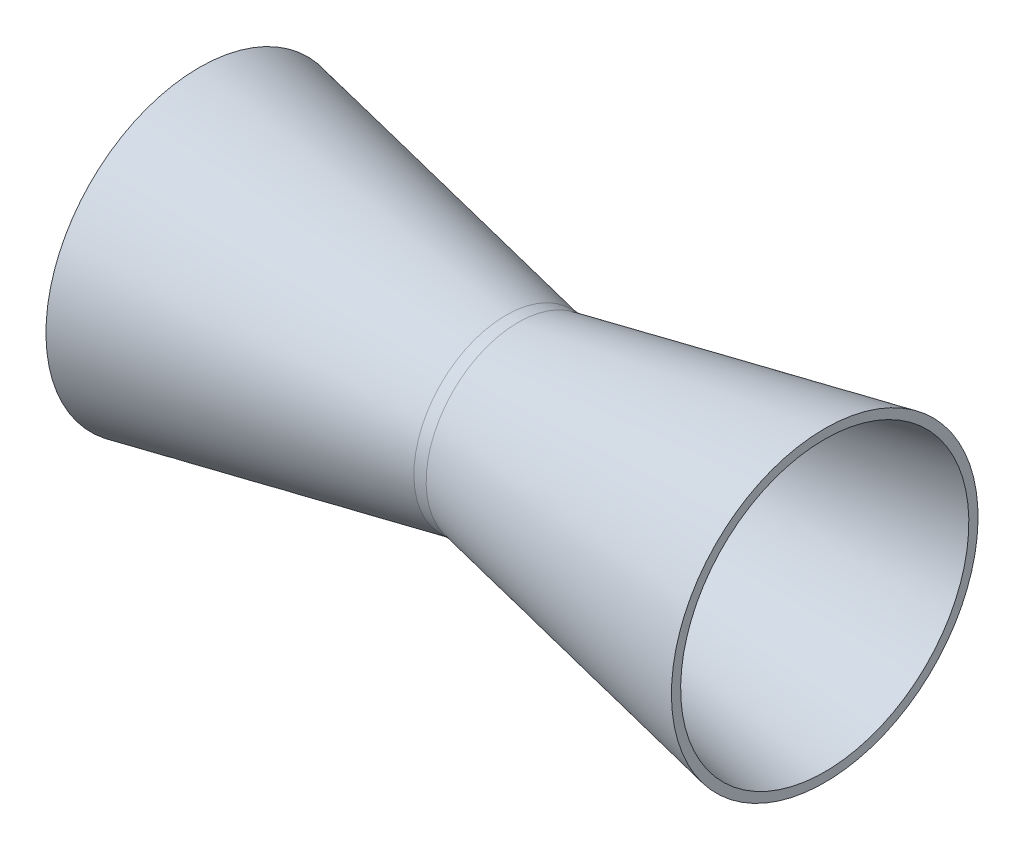
ISO-10303-21;
HEADER;
FILE_DESCRIPTION(('STEP AP214'),'2;1');
FILE_NAME('part.step','',(''),(''),'','','');
FILE_SCHEMA(('AUTOMOTIVE_DESIGN { 1 0 10303 214 1 1 1 1 }'));
ENDSEC;
DATA;
#1=APPLICATION_CONTEXT('core data for automotive mechanical design processes');
#2=APPLICATION_PROTOCOL_DEFINITION('international standard','automotive_design',2000,#1);
#3=PRODUCT_CONTEXT('',#1,'mechanical');
#4=PRODUCT('Part','Part','',(#3));
#5=PRODUCT_RELATED_PRODUCT_CATEGORY('part','',(#4));
#6=PRODUCT_DEFINITION_FORMATION('','',#4);
#7=PRODUCT_DEFINITION_CONTEXT('part definition',#1,'design');
#8=PRODUCT_DEFINITION('design','',#6,#7);
#9=PRODUCT_DEFINITION_SHAPE('','',#8);
#10=(LENGTH_UNIT() NAMED_UNIT(*) SI_UNIT(.MILLI.,.METRE.));
#11=(NAMED_UNIT(*) PLANE_ANGLE_UNIT() SI_UNIT($,.RADIAN.));
#12=(NAMED_UNIT(*) SI_UNIT($,.STERADIAN.) SOLID_ANGLE_UNIT());
#13=UNCERTAINTY_MEASURE_WITH_UNIT(LENGTH_MEASURE(1.E-05),#10,'distance_accuracy_value','');
#14=(GEOMETRIC_REPRESENTATION_CONTEXT(3) GLOBAL_UNCERTAINTY_ASSIGNED_CONTEXT((#13)) GLOBAL_UNIT_ASSIGNED_CONTEXT((#10,
#11,#12)) REPRESENTATION_CONTEXT('',''));
#15=CARTESIAN_POINT('',(0.,0.,0.));
#16=DIRECTION('',(0.,0.,1.));
#17=DIRECTION('',(1.,0.,0.));
#18=AXIS2_PLACEMENT_3D('',#15,#16,#17);
#19=CARTESIAN_POINT('',(0.,0.,0.));
#20=DIRECTION('',(1.,0.,0.));
#21=DIRECTION('',(0.,0.,-1.));
#22=AXIS2_PLACEMENT_3D('',#19,#20,#21);
#23=PLANE('',#22);
#24=CARTESIAN_POINT('',(0.,0.,0.));
#25=DIRECTION('',(1.,0.,0.));
#26=DIRECTION('',(0.,0.,-1.));
#27=AXIS2_PLACEMENT_3D('',#24,#25,#26);
#28=CIRCLE('',#27,47.);
#29=CARTESIAN_POINT('',(0.,0.,-47.));
#30=VERTEX_POINT('',#29);
#31=EDGE_CURVE('E122',#30,#30,#28,.T.);
#32=ORIENTED_EDGE('',*,*,#31,.T.);
#33=EDGE_LOOP('',(#32));
#34=FACE_BOUND('',#33,.T.);
#35=CARTESIAN_POINT('',(0.,0.,0.));
#36=DIRECTION('',(1.,0.,0.));
#37=DIRECTION('',(0.,0.,-1.));
#38=AXIS2_PLACEMENT_3D('',#35,#36,#37);
#39=CIRCLE('',#38,50.);
#40=CARTESIAN_POINT('',(0.,50.,0.));
#41=VERTEX_POINT('',#40);
#42=EDGE_CURVE('E115',#41,#41,#39,.T.);
#43=ORIENTED_EDGE('',*,*,#42,.F.);
#44=EDGE_LOOP('',(#43));
#45=FACE_BOUND('',#44,.T.);
#46=ADVANCED_FACE('F101',(#34,#45),#23,.F.);
#47=CARTESIAN_POINT('',(0.,50.,0.));
#48=CARTESIAN_POINT('',(33.3333333333333,43.3333333333333,0.));
#49=CARTESIAN_POINT('',(66.6666666666667,36.6666666666667,0.));
#50=CARTESIAN_POINT('',(100.,30.,0.));
#51=CARTESIAN_POINT('',(0.,50.,1.37978752480773));
#52=CARTESIAN_POINT('',(33.3333333333333,43.3333333333333,1.19581585483337));
#53=CARTESIAN_POINT('',(66.6666666666667,36.6666666666667,1.01184418485901));
#54=CARTESIAN_POINT('',(100.,30.,0.827872514884642));
#55=CARTESIAN_POINT('',(0.,49.8879787524808,4.11340506946168));
#56=CARTESIAN_POINT('',(33.3333333333333,43.23624825215,3.56495106020012));
#57=CARTESIAN_POINT('',(66.6666666666667,36.5845177518192,3.01649705093856));
#58=CARTESIAN_POINT('',(100.,29.9327872514885,2.46804304167701));
#59=CARTESIAN_POINT('',(0.,49.3967927000279,8.12304931017431));
#60=CARTESIAN_POINT('',(33.3333333333333,42.8105536733575,7.03997606881773));
#61=CARTESIAN_POINT('',(66.6666666666667,36.2243146466871,5.95690282746116));
#62=CARTESIAN_POINT('',(100.,29.6380756200167,4.87382958610459));
#63=CARTESIAN_POINT('',(0.,48.5953620277847,12.029001913235));
#64=CARTESIAN_POINT('',(33.3333333333333,42.11598042408,10.4251349914703));
#65=CARTESIAN_POINT('',(66.6666666666667,35.6365988203754,8.82126806970566));
#66=CARTESIAN_POINT('',(100.,29.1572172166708,7.217401147941));
#67=CARTESIAN_POINT('',(0.,42.0027676438849,34.7651103373854));
#68=CARTESIAN_POINT('',(33.3333333333333,36.4023986247003,30.1297622924007));
#69=CARTESIAN_POINT('',(66.6666666666667,30.8020296055156,25.494414247416));
#70=CARTESIAN_POINT('',(100.,25.201660586331,20.8590662024312));
#71=CARTESIAN_POINT('',(0.,22.076600396924,50.));
#72=CARTESIAN_POINT('',(33.3333333333333,19.1330536773341,43.3333333333333));
#73=CARTESIAN_POINT('',(66.6666666666667,16.1895069577443,36.6666666666667));
#74=CARTESIAN_POINT('',(100.,13.2459602381544,30.));
#75=CARTESIAN_POINT('',(0.,-27.595750496155,50.));
#76=CARTESIAN_POINT('',(33.3333333333333,-23.9163170966677,43.3333333333333));
#77=CARTESIAN_POINT('',(66.6666666666667,-20.2368836971803,36.6666666666667));
#78=CARTESIAN_POINT('',(100.,-16.557450297693,30.));
#79=CARTESIAN_POINT('',(0.,-50.,27.595750496155));
#80=CARTESIAN_POINT('',(33.3333333333333,-43.3333333333333,23.9163170966677));
#81=CARTESIAN_POINT('',(66.6666666666667,-36.6666666666667,20.2368836971803));
#82=CARTESIAN_POINT('',(100.,-30.,16.557450297693));
#83=CARTESIAN_POINT('',(0.,-50.,-27.595750496155));
#84=CARTESIAN_POINT('',(33.3333333333333,-43.3333333333333,-23.9163170966677));
#85=CARTESIAN_POINT('',(66.6666666666667,-36.6666666666667,-20.2368836971803));
#86=CARTESIAN_POINT('',(100.,-30.,-16.557450297693));
#87=CARTESIAN_POINT('',(0.,-27.595750496155,-50.));
#88=CARTESIAN_POINT('',(33.3333333333333,-23.9163170966677,-43.3333333333333));
#89=CARTESIAN_POINT('',(66.6666666666667,-20.2368836971803,-36.6666666666667));
#90=CARTESIAN_POINT('',(100.,-16.557450297693,-30.));
#91=CARTESIAN_POINT('',(0.,22.076600396924,-50.));
#92=CARTESIAN_POINT('',(33.3333333333333,19.1330536773341,-43.3333333333333));
#93=CARTESIAN_POINT('',(66.6666666666667,16.1895069577443,-36.6666666666667));
#94=CARTESIAN_POINT('',(100.,13.2459602381544,-30.));
#95=CARTESIAN_POINT('',(0.,42.0027676438849,-34.7651103373854));
#96=CARTESIAN_POINT('',(33.3333333333333,36.4023986247003,-30.1297622924007));
#97=CARTESIAN_POINT('',(66.6666666666667,30.8020296055156,-25.494414247416));
#98=CARTESIAN_POINT('',(100.,25.201660586331,-20.8590662024312));
#99=CARTESIAN_POINT('',(0.,48.5953620277847,-12.029001913235));
#100=CARTESIAN_POINT('',(33.3333333333333,42.1159804240801,-10.4251349914703));
#101=CARTESIAN_POINT('',(66.6666666666667,35.6365988203754,-8.82126806970568));
#102=CARTESIAN_POINT('',(100.,29.1572172166708,-7.21740114794101));
#103=CARTESIAN_POINT('',(0.,49.3967927000279,-8.12304931017433));
#104=CARTESIAN_POINT('',(33.3333333333333,42.8105536733575,-7.03997606881776));
#105=CARTESIAN_POINT('',(66.6666666666667,36.2243146466871,-5.95690282746118));
#106=CARTESIAN_POINT('',(100.,29.6380756200167,-4.8738295861046));
#107=CARTESIAN_POINT('',(0.,49.8879787524808,-4.11340506946171));
#108=CARTESIAN_POINT('',(33.3333333333333,43.23624825215,-3.56495106020015));
#109=CARTESIAN_POINT('',(66.6666666666667,36.5845177518192,-3.01649705093859));
#110=CARTESIAN_POINT('',(100.,29.9327872514885,-2.46804304167702));
#111=CARTESIAN_POINT('',(0.,50.,-1.37978752480776));
#112=CARTESIAN_POINT('',(33.3333333333333,43.3333333333333,-1.19581585483339));
#113=CARTESIAN_POINT('',(66.6666666666667,36.6666666666667,-1.01184418485902));
#114=CARTESIAN_POINT('',(100.,30.,-0.827872514884652));
#115=CARTESIAN_POINT('',(0.,50.,0.));
#116=CARTESIAN_POINT('',(33.3333333333333,43.3333333333333,0.));
#117=CARTESIAN_POINT('',(66.6666666666667,36.6666666666667,0.));
#118=CARTESIAN_POINT('',(100.,30.,0.));
#119=B_SPLINE_SURFACE_WITH_KNOTS('',3,3,((#47,#48,#49,#50),(#51,#52,#53,#54),(#55,#56,#57,#58),
(#59,#60,#61,#62),(#63,#64,#65,#66),(#67,#68,#69,#70),(#71,#72,#73,#74),(#75,#76,#77,#78),(#79,
#80,#81,#82),(#83,#84,#85,#86),(#87,#88,#89,#90),(#91,#92,#93,#94),(#95,#96,#97,#98),(#99,#100,
#101,#102),(#103,#104,#105,#106),(#107,#108,#109,#110),(#111,#112,#113,#114),(#115,#116,#117,
#118)),.UNSPECIFIED.,.T.,.F.,.F.,(4,1,1,1,1,2,2,2,1,1,1,1,4),(4,4),(0.,0.0125,
0.0249999999999999,0.0375000000000001,0.05,0.25,0.5,0.75,0.95,0.9625,0.975,0.9875,1.),(0.,1.),.UNSPECIFIED.);
#120=CARTESIAN_POINT('',(100.,0.,0.));
#121=DIRECTION('',(1.,0.,0.));
#122=DIRECTION('',(0.,0.,-1.));
#123=AXIS2_PLACEMENT_3D('',#120,#121,#122);
#124=CIRCLE('',#123,30.);
#125=CARTESIAN_POINT('',(100.,30.,0.));
#126=VERTEX_POINT('',#125);
#127=EDGE_CURVE('E12',#126,#126,#124,.T.);
#128=CARTESIAN_POINT('',(0.,50.,0.));
#129=CARTESIAN_POINT('',(1.04166666666667,49.7916666666667,0.));
#130=CARTESIAN_POINT('',(2.08333333333333,49.5833333333333,0.));
#131=CARTESIAN_POINT('',(4.16666666666667,49.1666666666667,0.));
#132=CARTESIAN_POINT('',(5.20833333333333,48.9583333333333,0.));
#133=CARTESIAN_POINT('',(7.29166666666667,48.5416666666667,0.));
#134=CARTESIAN_POINT('',(8.33333333333334,48.3333333333333,0.));
#135=CARTESIAN_POINT('',(10.4166666666667,47.9166666666667,0.));
#136=CARTESIAN_POINT('',(11.4583333333333,47.7083333333333,0.));
#137=CARTESIAN_POINT('',(13.5416666666667,47.2916666666667,0.));
#138=CARTESIAN_POINT('',(14.5833333333333,47.0833333333333,0.));
#139=CARTESIAN_POINT('',(16.6666666666667,46.6666666666667,0.));
#140=CARTESIAN_POINT('',(17.7083333333333,46.4583333333333,0.));
#141=CARTESIAN_POINT('',(19.7916666666667,46.0416666666667,0.));
#142=CARTESIAN_POINT('',(20.8333333333333,45.8333333333333,0.));
#143=CARTESIAN_POINT('',(22.9166666666667,45.4166666666667,0.));
#144=CARTESIAN_POINT('',(23.9583333333333,45.2083333333333,0.));
#145=CARTESIAN_POINT('',(26.0416666666667,44.7916666666667,0.));
#146=CARTESIAN_POINT('',(27.0833333333333,44.5833333333333,0.));
#147=CARTESIAN_POINT('',(29.1666666666667,44.1666666666667,0.));
#148=CARTESIAN_POINT('',(30.2083333333333,43.9583333333333,0.));
#149=CARTESIAN_POINT('',(32.2916666666667,43.5416666666667,0.));
#150=CARTESIAN_POINT('',(33.3333333333333,43.3333333333333,0.));
#151=CARTESIAN_POINT('',(35.4166666666667,42.9166666666667,0.));
#152=CARTESIAN_POINT('',(36.4583333333333,42.7083333333333,0.));
#153=CARTESIAN_POINT('',(38.5416666666667,42.2916666666667,0.));
#154=CARTESIAN_POINT('',(39.5833333333333,42.0833333333333,0.));
#155=CARTESIAN_POINT('',(41.6666666666667,41.6666666666667,0.));
#156=CARTESIAN_POINT('',(42.7083333333333,41.4583333333333,0.));
#157=CARTESIAN_POINT('',(44.7916666666667,41.0416666666667,0.));
#158=CARTESIAN_POINT('',(45.8333333333333,40.8333333333333,0.));
#159=CARTESIAN_POINT('',(47.9166666666667,40.4166666666667,0.));
#160=CARTESIAN_POINT('',(48.9583333333333,40.2083333333333,0.));
#161=CARTESIAN_POINT('',(51.0416666666667,39.7916666666667,0.));
#162=CARTESIAN_POINT('',(52.0833333333333,39.5833333333333,0.));
#163=CARTESIAN_POINT('',(54.1666666666667,39.1666666666667,0.));
#164=CARTESIAN_POINT('',(55.2083333333333,38.9583333333333,0.));
#165=CARTESIAN_POINT('',(57.2916666666667,38.5416666666667,0.));
#166=CARTESIAN_POINT('',(58.3333333333333,38.3333333333333,0.));
#167=CARTESIAN_POINT('',(60.4166666666667,37.9166666666667,0.));
#168=CARTESIAN_POINT('',(61.4583333333333,37.7083333333333,0.));
#169=CARTESIAN_POINT('',(63.5416666666667,37.2916666666667,0.));
#170=CARTESIAN_POINT('',(64.5833333333333,37.0833333333333,0.));
#171=CARTESIAN_POINT('',(66.6666666666667,36.6666666666667,0.));
#172=CARTESIAN_POINT('',(67.7083333333333,36.4583333333333,0.));
#173=CARTESIAN_POINT('',(69.7916666666667,36.0416666666667,0.));
#174=CARTESIAN_POINT('',(70.8333333333333,35.8333333333333,0.));
#175=CARTESIAN_POINT('',(72.9166666666667,35.4166666666667,0.));
#176=CARTESIAN_POINT('',(73.9583333333333,35.2083333333333,0.));
#177=CARTESIAN_POINT('',(76.0416666666667,34.7916666666667,0.));
#178=CARTESIAN_POINT('',(77.0833333333333,34.5833333333333,0.));
#179=CARTESIAN_POINT('',(79.1666666666667,34.1666666666667,0.));
#180=CARTESIAN_POINT('',(80.2083333333333,33.9583333333333,0.));
#181=CARTESIAN_POINT('',(82.2916666666667,33.5416666666667,0.));
#182=CARTESIAN_POINT('',(83.3333333333333,33.3333333333333,0.));
#183=CARTESIAN_POINT('',(85.4166666666667,32.9166666666667,0.));
#184=CARTESIAN_POINT('',(86.4583333333333,32.7083333333333,0.));
#185=CARTESIAN_POINT('',(88.5416666666667,32.2916666666667,0.));
#186=CARTESIAN_POINT('',(89.5833333333333,32.0833333333333,0.));
#187=CARTESIAN_POINT('',(91.6666666666667,31.6666666666667,0.));
#188=CARTESIAN_POINT('',(92.7083333333333,31.4583333333333,0.));
#189=CARTESIAN_POINT('',(94.7916666666667,31.0416666666667,0.));
#190=CARTESIAN_POINT('',(95.8333333333333,30.8333333333333,0.));
#191=CARTESIAN_POINT('',(97.9166666666667,30.4166666666667,0.));
#192=CARTESIAN_POINT('',(98.9583333333333,30.2083333333333,0.));
#193=CARTESIAN_POINT('',(100.,30.,0.));
#194=B_SPLINE_CURVE_WITH_KNOTS('',3,(#128,#129,#130,#131,#132,#133,#134,#135,#136,#137,#138,
#139,#140,#141,#142,#143,#144,#145,#146,#147,#148,#149,#150,#151,#152,#153,#154,#155,#156,#157,
#158,#159,#160,#161,#162,#163,#164,#165,#166,#167,#168,#169,#170,#171,#172,#173,#174,#175,#176,
#177,#178,#179,#180,#181,#182,#183,#184,#185,#186,#187,#188,#189,#190,#191,#192,#193),
.UNSPECIFIED.,.F.,.F.,(4,2,2,2,2,2,2,2,2,2,2,2,2,2,2,2,2,2,2,2,2,2,2,2,2,2,2,2,2,2,2,2,4),(0.,
3.18688719599549,6.37377439199098,9.56066158798647,12.747548783982,15.9344359799775,
19.1213231759729,22.3082103719684,25.4950975679639,28.6819847639594,31.8688719599549,
35.0557591559504,38.2426463519459,41.4295335479414,44.6164207439369,47.8033079399324,
50.9901951359279,54.1770823319233,57.3639695279188,60.5508567239143,63.7377439199098,
66.9246311159053,70.1115183119008,73.2984055078963,76.4852927038918,79.6721798998873,
82.8590670958828,86.0459542918783,89.2328414878738,92.4197286838693,95.6066158798647,
98.7935030758602,101.980390271856),.UNSPECIFIED.);
#195=EDGE_CURVE('BSEAM103',#41,#126,#194,.T.);
#196=ORIENTED_EDGE('',*,*,#42,.T.);
#197=ORIENTED_EDGE('',*,*,#127,.F.);
#198=ORIENTED_EDGE('',*,*,#195,.T.);
#199=ORIENTED_EDGE('',*,*,#195,.F.);
#200=EDGE_LOOP('',(#196,#198,#197,#199));
#201=FACE_BOUND('',#200,.T.);
#202=ADVANCED_FACE('F103',(#201),#119,.T.);
#203=CARTESIAN_POINT('',(100.,0.,0.));
#204=DIRECTION('',(-1.,0.,0.));
#205=DIRECTION('',(0.,0.,1.));
#206=AXIS2_PLACEMENT_3D('',#203,#204,#205);
#207=CONICAL_SURFACE('',#206,28.,0.187761946513593);
#208=ORIENTED_EDGE('',*,*,#31,.F.);
#209=EDGE_LOOP('',(#208));
#210=FACE_BOUND('',#209,.T.);
#211=CARTESIAN_POINT('',(100.,0.,0.));
#212=DIRECTION('',(1.,0.,0.));
#213=DIRECTION('',(0.,0.,-1.));
#214=AXIS2_PLACEMENT_3D('',#211,#212,#213);
#215=CIRCLE('',#214,28.);
#216=CARTESIAN_POINT('',(100.,0.,-28.));
#217=VERTEX_POINT('',#216);
#218=EDGE_CURVE('E133',#217,#217,#215,.T.);
#219=ORIENTED_EDGE('',*,*,#218,.T.);
#220=EDGE_LOOP('',(#219));
#221=FACE_BOUND('',#220,.T.);
#222=ADVANCED_FACE('F156',(#210,#221),#207,.F.);
#223=CARTESIAN_POINT('',(104.,0.,0.));
#224=DIRECTION('',(-1.,0.,0.));
#225=DIRECTION('',(0.,0.,1.));
#226=AXIS2_PLACEMENT_3D('',#223,#224,#225);
#227=CYLINDRICAL_SURFACE('',#226,30.);
#228=CARTESIAN_POINT('',(104.,0.,0.));
#229=DIRECTION('',(1.,0.,0.));
#230=DIRECTION('',(0.,0.,-1.));
#231=AXIS2_PLACEMENT_3D('',#228,#229,#230);
#232=CIRCLE('',#231,30.);
#233=CARTESIAN_POINT('',(104.,30.,0.));
#234=VERTEX_POINT('',#233);
#235=EDGE_CURVE('E129',#234,#234,#232,.T.);
#236=ORIENTED_EDGE('',*,*,#235,.F.);
#237=EDGE_LOOP('',(#236));
#238=FACE_BOUND('',#237,.T.);
#239=ORIENTED_EDGE('',*,*,#127,.T.);
#240=EDGE_LOOP('',(#239));
#241=FACE_BOUND('',#240,.T.);
#242=ADVANCED_FACE('F145',(#238,#241),#227,.T.);
#243=CARTESIAN_POINT('',(104.,0.,0.));
#244=DIRECTION('',(-1.,0.,0.));
#245=DIRECTION('',(0.,0.,1.));
#246=AXIS2_PLACEMENT_3D('',#243,#244,#245);
#247=CYLINDRICAL_SURFACE('',#246,28.);
#248=CARTESIAN_POINT('',(104.,0.,0.));
#249=DIRECTION('',(1.,0.,0.));
#250=DIRECTION('',(0.,0.,-1.));
#251=AXIS2_PLACEMENT_3D('',#248,#249,#250);
#252=CIRCLE('',#251,28.);
#253=CARTESIAN_POINT('',(104.,28.,0.));
#254=VERTEX_POINT('',#253);
#255=EDGE_CURVE('E219',#254,#254,#252,.T.);
#256=ORIENTED_EDGE('',*,*,#255,.T.);
#257=EDGE_LOOP('',(#256));
#258=FACE_BOUND('',#257,.T.);
#259=ORIENTED_EDGE('',*,*,#218,.F.);
#260=EDGE_LOOP('',(#259));
#261=FACE_BOUND('',#260,.T.);
#262=ADVANCED_FACE('F155',(#258,#261),#247,.F.);
#263=CARTESIAN_POINT('',(204.,0.,0.));
#264=DIRECTION('',(1.,0.,0.));
#265=DIRECTION('',(0.,0.,-1.));
#266=AXIS2_PLACEMENT_3D('',#263,#264,#265);
#267=PLANE('',#266);
#268=CARTESIAN_POINT('',(204.,0.,0.));
#269=DIRECTION('',(1.,0.,0.));
#270=DIRECTION('',(0.,0.,-1.));
#271=AXIS2_PLACEMENT_3D('',#268,#269,#270);
#272=CIRCLE('',#271,47.);
#273=CARTESIAN_POINT('',(204.,47.,0.));
#274=VERTEX_POINT('',#273);
#275=EDGE_CURVE('E281',#274,#274,#272,.T.);
#276=ORIENTED_EDGE('',*,*,#275,.F.);
#277=EDGE_LOOP('',(#276));
#278=FACE_BOUND('',#277,.T.);
#279=CARTESIAN_POINT('',(204.,0.,0.));
#280=DIRECTION('',(1.,0.,0.));
#281=DIRECTION('',(0.,0.,-1.));
#282=AXIS2_PLACEMENT_3D('',#279,#280,#281);
#283=CIRCLE('',#282,50.);
#284=CARTESIAN_POINT('',(204.,50.,0.));
#285=VERTEX_POINT('',#284);
#286=EDGE_CURVE('E216',#285,#285,#283,.T.);
#287=ORIENTED_EDGE('',*,*,#286,.T.);
#288=EDGE_LOOP('',(#287));
#289=FACE_BOUND('',#288,.T.);
#290=ADVANCED_FACE('F228',(#278,#289),#267,.T.);
#291=CARTESIAN_POINT('',(104.,30.,0.));
#292=CARTESIAN_POINT('',(137.333333333333,36.6666666666667,0.));
#293=CARTESIAN_POINT('',(170.666666666667,43.3333333333333,0.));
#294=CARTESIAN_POINT('',(204.,50.,0.));
#295=CARTESIAN_POINT('',(104.,30.,0.827872514884642));
#296=CARTESIAN_POINT('',(137.333333333333,36.6666666666667,1.01184418485901));
#297=CARTESIAN_POINT('',(170.666666666667,43.3333333333333,1.19581585483337));
#298=CARTESIAN_POINT('',(204.,50.,1.37978752480773));
#299=CARTESIAN_POINT('',(104.,29.9327872514885,2.46804304167701));
#300=CARTESIAN_POINT('',(137.333333333333,36.5845177518192,3.01649705093856));
#301=CARTESIAN_POINT('',(170.666666666667,43.23624825215,3.56495106020012));
#302=CARTESIAN_POINT('',(204.,49.8879787524808,4.11340506946168));
#303=CARTESIAN_POINT('',(104.,29.6380756200167,4.87382958610459));
#304=CARTESIAN_POINT('',(137.333333333333,36.2243146466871,5.95690282746116));
#305=CARTESIAN_POINT('',(170.666666666667,42.8105536733575,7.03997606881774));
#306=CARTESIAN_POINT('',(204.,49.3967927000279,8.12304931017431));
#307=CARTESIAN_POINT('',(104.,29.1572172166708,7.217401147941));
#308=CARTESIAN_POINT('',(137.333333333333,35.6365988203754,8.82126806970566));
#309=CARTESIAN_POINT('',(170.666666666667,42.11598042408,10.4251349914703));
#310=CARTESIAN_POINT('',(204.,48.5953620277847,12.029001913235));
#311=CARTESIAN_POINT('',(104.,25.201660586331,20.8590662024312));
#312=CARTESIAN_POINT('',(137.333333333333,30.8020296055156,25.494414247416));
#313=CARTESIAN_POINT('',(170.666666666667,36.4023986247003,30.1297622924007));
#314=CARTESIAN_POINT('',(204.,42.0027676438849,34.7651103373854));
#315=CARTESIAN_POINT('',(104.,13.2459602381544,30.));
#316=CARTESIAN_POINT('',(137.333333333333,16.1895069577443,36.6666666666667));
#317=CARTESIAN_POINT('',(170.666666666667,19.1330536773341,43.3333333333333));
#318=CARTESIAN_POINT('',(204.,22.076600396924,50.));
#319=CARTESIAN_POINT('',(104.,-16.557450297693,30.));
#320=CARTESIAN_POINT('',(137.333333333333,-20.2368836971803,36.6666666666667));
#321=CARTESIAN_POINT('',(170.666666666667,-23.9163170966677,43.3333333333333));
#322=CARTESIAN_POINT('',(204.,-27.595750496155,50.));
#323=CARTESIAN_POINT('',(104.,-30.,16.557450297693));
#324=CARTESIAN_POINT('',(137.333333333333,-36.6666666666667,20.2368836971803));
#325=CARTESIAN_POINT('',(170.666666666667,-43.3333333333333,23.9163170966677));
#326=CARTESIAN_POINT('',(204.,-50.,27.595750496155));
#327=CARTESIAN_POINT('',(104.,-30.,-16.557450297693));
#328=CARTESIAN_POINT('',(137.333333333333,-36.6666666666667,-20.2368836971803));
#329=CARTESIAN_POINT('',(170.666666666667,-43.3333333333333,-23.9163170966677));
#330=CARTESIAN_POINT('',(204.,-50.,-27.595750496155));
#331=CARTESIAN_POINT('',(104.,-16.557450297693,-30.));
#332=CARTESIAN_POINT('',(137.333333333333,-20.2368836971803,-36.6666666666667));
#333=CARTESIAN_POINT('',(170.666666666667,-23.9163170966677,-43.3333333333333));
#334=CARTESIAN_POINT('',(204.,-27.595750496155,-50.));
#335=CARTESIAN_POINT('',(104.,13.2459602381544,-30.));
#336=CARTESIAN_POINT('',(137.333333333333,16.1895069577443,-36.6666666666667));
#337=CARTESIAN_POINT('',(170.666666666667,19.1330536773341,-43.3333333333333));
#338=CARTESIAN_POINT('',(204.,22.076600396924,-50.));
#339=CARTESIAN_POINT('',(104.,25.201660586331,-20.8590662024312));
#340=CARTESIAN_POINT('',(137.333333333333,30.8020296055156,-25.494414247416));
#341=CARTESIAN_POINT('',(170.666666666667,36.4023986247003,-30.1297622924007));
#342=CARTESIAN_POINT('',(204.,42.0027676438849,-34.7651103373854));
#343=CARTESIAN_POINT('',(104.,29.1572172166708,-7.21740114794101));
#344=CARTESIAN_POINT('',(137.333333333333,35.6365988203754,-8.82126806970568));
#345=CARTESIAN_POINT('',(170.666666666667,42.1159804240801,-10.4251349914703));
#346=CARTESIAN_POINT('',(204.,48.5953620277847,-12.029001913235));
#347=CARTESIAN_POINT('',(104.,29.6380756200167,-4.8738295861046));
#348=CARTESIAN_POINT('',(137.333333333333,36.2243146466871,-5.95690282746118));
#349=CARTESIAN_POINT('',(170.666666666667,42.8105536733575,-7.03997606881776));
#350=CARTESIAN_POINT('',(204.,49.3967927000279,-8.12304931017433));
#351=CARTESIAN_POINT('',(104.,29.9327872514885,-2.46804304167702));
#352=CARTESIAN_POINT('',(137.333333333333,36.5845177518192,-3.01649705093859));
#353=CARTESIAN_POINT('',(170.666666666667,43.23624825215,-3.56495106020015));
#354=CARTESIAN_POINT('',(204.,49.8879787524808,-4.11340506946171));
#355=CARTESIAN_POINT('',(104.,30.,-0.827872514884652));
#356=CARTESIAN_POINT('',(137.333333333333,36.6666666666667,-1.01184418485902));
#357=CARTESIAN_POINT('',(170.666666666667,43.3333333333333,-1.19581585483339));
#358=CARTESIAN_POINT('',(204.,50.,-1.37978752480776));
#359=CARTESIAN_POINT('',(104.,30.,0.));
#360=CARTESIAN_POINT('',(137.333333333333,36.6666666666667,0.));
#361=CARTESIAN_POINT('',(170.666666666667,43.3333333333333,0.));
#362=CARTESIAN_POINT('',(204.,50.,0.));
#363=B_SPLINE_SURFACE_WITH_KNOTS('',3,3,((#291,#292,#293,#294),(#295,#296,#297,#298),(#299,#300,
#301,#302),(#303,#304,#305,#306),(#307,#308,#309,#310),(#311,#312,#313,#314),(#315,#316,#317,
#318),(#319,#320,#321,#322),(#323,#324,#325,#326),(#327,#328,#329,#330),(#331,#332,#333,#334),
(#335,#336,#337,#338),(#339,#340,#341,#342),(#343,#344,#345,#346),(#347,#348,#349,#350),(#351,
#352,#353,#354),(#355,#356,#357,#358),(#359,#360,#361,#362)),.UNSPECIFIED.,.T.,.F.,.F.,(4,1,1,1,
1,2,2,2,1,1,1,1,4),(4,4),(0.,0.0125,0.0249999999999999,0.0375000000000001,0.05,0.25,0.5,0.75,
0.95,0.9625,0.975,0.9875,1.),(0.,1.),.UNSPECIFIED.);
#364=CARTESIAN_POINT('',(104.,30.,0.));
#365=CARTESIAN_POINT('',(105.041666666667,30.2083333333333,0.));
#366=CARTESIAN_POINT('',(106.083333333333,30.4166666666667,0.));
#367=CARTESIAN_POINT('',(108.166666666667,30.8333333333333,0.));
#368=CARTESIAN_POINT('',(109.208333333333,31.0416666666667,0.));
#369=CARTESIAN_POINT('',(111.291666666667,31.4583333333333,0.));
#370=CARTESIAN_POINT('',(112.333333333333,31.6666666666667,0.));
#371=CARTESIAN_POINT('',(114.416666666667,32.0833333333333,0.));
#372=CARTESIAN_POINT('',(115.458333333333,32.2916666666667,0.));
#373=CARTESIAN_POINT('',(117.541666666667,32.7083333333333,0.));
#374=CARTESIAN_POINT('',(118.583333333333,32.9166666666667,0.));
#375=CARTESIAN_POINT('',(120.666666666667,33.3333333333333,0.));
#376=CARTESIAN_POINT('',(121.708333333333,33.5416666666667,0.));
#377=CARTESIAN_POINT('',(123.791666666667,33.9583333333333,0.));
#378=CARTESIAN_POINT('',(124.833333333333,34.1666666666667,0.));
#379=CARTESIAN_POINT('',(126.916666666667,34.5833333333333,0.));
#380=CARTESIAN_POINT('',(127.958333333333,34.7916666666667,0.));
#381=CARTESIAN_POINT('',(130.041666666667,35.2083333333333,0.));
#382=CARTESIAN_POINT('',(131.083333333333,35.4166666666667,0.));
#383=CARTESIAN_POINT('',(133.166666666667,35.8333333333333,0.));
#384=CARTESIAN_POINT('',(134.208333333333,36.0416666666667,0.));
#385=CARTESIAN_POINT('',(136.291666666667,36.4583333333333,0.));
#386=CARTESIAN_POINT('',(137.333333333333,36.6666666666667,0.));
#387=CARTESIAN_POINT('',(139.416666666667,37.0833333333333,0.));
#388=CARTESIAN_POINT('',(140.458333333333,37.2916666666667,0.));
#389=CARTESIAN_POINT('',(142.541666666667,37.7083333333333,0.));
#390=CARTESIAN_POINT('',(143.583333333333,37.9166666666667,0.));
#391=CARTESIAN_POINT('',(145.666666666667,38.3333333333333,0.));
#392=CARTESIAN_POINT('',(146.708333333333,38.5416666666667,0.));
#393=CARTESIAN_POINT('',(148.791666666667,38.9583333333333,0.));
#394=CARTESIAN_POINT('',(149.833333333333,39.1666666666667,0.));
#395=CARTESIAN_POINT('',(151.916666666667,39.5833333333333,0.));
#396=CARTESIAN_POINT('',(152.958333333333,39.7916666666667,0.));
#397=CARTESIAN_POINT('',(155.041666666667,40.2083333333333,0.));
#398=CARTESIAN_POINT('',(156.083333333333,40.4166666666667,0.));
#399=CARTESIAN_POINT('',(158.166666666667,40.8333333333333,0.));
#400=CARTESIAN_POINT('',(159.208333333333,41.0416666666667,0.));
#401=CARTESIAN_POINT('',(161.291666666667,41.4583333333333,0.));
#402=CARTESIAN_POINT('',(162.333333333333,41.6666666666667,0.));
#403=CARTESIAN_POINT('',(164.416666666667,42.0833333333333,0.));
#404=CARTESIAN_POINT('',(165.458333333333,42.2916666666667,0.));
#405=CARTESIAN_POINT('',(167.541666666667,42.7083333333333,0.));
#406=CARTESIAN_POINT('',(168.583333333333,42.9166666666667,0.));
#407=CARTESIAN_POINT('',(170.666666666667,43.3333333333333,0.));
#408=CARTESIAN_POINT('',(171.708333333333,43.5416666666667,0.));
#409=CARTESIAN_POINT('',(173.791666666667,43.9583333333333,0.));
#410=CARTESIAN_POINT('',(174.833333333333,44.1666666666667,0.));
#411=CARTESIAN_POINT('',(176.916666666667,44.5833333333333,0.));
#412=CARTESIAN_POINT('',(177.958333333333,44.7916666666667,0.));
#413=CARTESIAN_POINT('',(180.041666666667,45.2083333333333,0.));
#414=CARTESIAN_POINT('',(181.083333333333,45.4166666666667,0.));
#415=CARTESIAN_POINT('',(183.166666666667,45.8333333333333,0.));
#416=CARTESIAN_POINT('',(184.208333333333,46.0416666666667,0.));
#417=CARTESIAN_POINT('',(186.291666666667,46.4583333333333,0.));
#418=CARTESIAN_POINT('',(187.333333333333,46.6666666666667,0.));
#419=CARTESIAN_POINT('',(189.416666666667,47.0833333333333,0.));
#420=CARTESIAN_POINT('',(190.458333333333,47.2916666666667,0.));
#421=CARTESIAN_POINT('',(192.541666666667,47.7083333333333,0.));
#422=CARTESIAN_POINT('',(193.583333333333,47.9166666666667,0.));
#423=CARTESIAN_POINT('',(195.666666666667,48.3333333333333,0.));
#424=CARTESIAN_POINT('',(196.708333333333,48.5416666666667,0.));
#425=CARTESIAN_POINT('',(198.791666666667,48.9583333333333,0.));
#426=CARTESIAN_POINT('',(199.833333333333,49.1666666666667,0.));
#427=CARTESIAN_POINT('',(201.916666666667,49.5833333333333,0.));
#428=CARTESIAN_POINT('',(202.958333333333,49.7916666666667,0.));
#429=CARTESIAN_POINT('',(204.,50.,0.));
#430=B_SPLINE_CURVE_WITH_KNOTS('',3,(#364,#365,#366,#367,#368,#369,#370,#371,#372,#373,#374,
#375,#376,#377,#378,#379,#380,#381,#382,#383,#384,#385,#386,#387,#388,#389,#390,#391,#392,#393,
#394,#395,#396,#397,#398,#399,#400,#401,#402,#403,#404,#405,#406,#407,#408,#409,#410,#411,#412,
#413,#414,#415,#416,#417,#418,#419,#420,#421,#422,#423,#424,#425,#426,#427,#428,#429),
.UNSPECIFIED.,.F.,.F.,(4,2,2,2,2,2,2,2,2,2,2,2,2,2,2,2,2,2,2,2,2,2,2,2,2,2,2,2,2,2,2,2,4),(0.,
3.18688719599548,6.37377439199097,9.56066158798648,12.747548783982,15.9344359799775,
19.1213231759729,22.3082103719684,25.4950975679639,28.6819847639594,31.8688719599549,
35.0557591559504,38.2426463519459,41.4295335479414,44.6164207439368,47.8033079399324,
50.9901951359279,54.1770823319233,57.3639695279188,60.5508567239143,63.7377439199098,
66.9246311159053,70.1115183119008,73.2984055078963,76.4852927038918,79.6721798998873,
82.8590670958828,86.0459542918783,89.2328414878738,92.4197286838693,95.6066158798647,
98.7935030758603,101.980390271856),.UNSPECIFIED.);
#431=EDGE_CURVE('BSEAM237',#234,#285,#430,.T.);
#432=ORIENTED_EDGE('',*,*,#235,.T.);
#433=ORIENTED_EDGE('',*,*,#286,.F.);
#434=ORIENTED_EDGE('',*,*,#431,.T.);
#435=ORIENTED_EDGE('',*,*,#431,.F.);
#436=EDGE_LOOP('',(#432,#434,#433,#435));
#437=FACE_BOUND('',#436,.T.);
#438=ADVANCED_FACE('F237',(#437),#363,.T.);
#439=CARTESIAN_POINT('',(204.,47.,0.));
#440=CARTESIAN_POINT('',(170.666666666667,40.6666666666667,0.));
#441=CARTESIAN_POINT('',(137.333333333333,34.3333333333333,0.));
#442=CARTESIAN_POINT('',(104.,28.,0.));
#443=CARTESIAN_POINT('',(204.,47.,-1.29700027331929));
#444=CARTESIAN_POINT('',(170.666666666667,40.6666666666667,-1.12222718684364));
#445=CARTESIAN_POINT('',(137.333333333333,34.3333333333333,-0.947454100367992));
#446=CARTESIAN_POINT('',(104.,28.,-0.772681013892343));
#447=CARTESIAN_POINT('',(204.,46.8947000273319,-3.86660076529399));
#448=CARTESIAN_POINT('',(170.666666666667,40.5755560520177,-3.34556945649551));
#449=CARTESIAN_POINT('',(137.333333333333,34.2564120767035,-2.82453814769703));
#450=CARTESIAN_POINT('',(104.,27.9372681013892,-2.30350683889855));
#451=CARTESIAN_POINT('',(204.,46.4329851380262,-7.63566635156387));
#452=CARTESIAN_POINT('',(170.666666666667,40.1760580626894,-6.60674677227512));
#453=CARTESIAN_POINT('',(137.333333333333,33.9191309873525,-5.57782719298637));
#454=CARTESIAN_POINT('',(104.,27.6622039120156,-4.54890761369762));
#455=CARTESIAN_POINT('',(204.,45.6796403061176,-11.3072617984409));
#456=CARTESIAN_POINT('',(170.666666666667,39.5242277825982,-9.78358822276448));
#457=CARTESIAN_POINT('',(137.333333333333,33.3688152590788,-8.25991464708804));
#458=CARTESIAN_POINT('',(104.,27.2134027355594,-6.73624107141161));
#459=CARTESIAN_POINT('',(204.,39.4826015852518,-32.6792037171423));
#460=CARTESIAN_POINT('',(170.666666666667,34.1622510170264,-28.2756230744068));
#461=CARTESIAN_POINT('',(137.333333333333,28.841900448801,-23.8720424316713));
#462=CARTESIAN_POINT('',(104.,23.5215498805756,-19.4684617889358));
#463=CARTESIAN_POINT('',(204.,20.7520043731085,-47.));
#464=CARTESIAN_POINT('',(170.666666666667,17.9556349894982,-40.6666666666667));
#465=CARTESIAN_POINT('',(137.333333333333,15.1592656058878,-34.3333333333333));
#466=CARTESIAN_POINT('',(104.,12.3628962222774,-28.));
#467=CARTESIAN_POINT('',(204.,-25.9400054663857,-47.));
#468=CARTESIAN_POINT('',(170.666666666667,-22.4445437368727,-40.6666666666667));
#469=CARTESIAN_POINT('',(137.333333333333,-18.9490820073598,-34.3333333333333));
#470=CARTESIAN_POINT('',(104.,-15.4536202778468,-28.));
#471=CARTESIAN_POINT('',(204.,-47.,-25.9400054663857));
#472=CARTESIAN_POINT('',(170.666666666667,-40.6666666666667,-22.4445437368727));
#473=CARTESIAN_POINT('',(137.333333333333,-34.3333333333333,-18.9490820073598));
#474=CARTESIAN_POINT('',(104.,-28.,-15.4536202778468));
#475=CARTESIAN_POINT('',(204.,-47.,25.9400054663857));
#476=CARTESIAN_POINT('',(170.666666666667,-40.6666666666667,22.4445437368727));
#477=CARTESIAN_POINT('',(137.333333333333,-34.3333333333333,18.9490820073598));
#478=CARTESIAN_POINT('',(104.,-28.,15.4536202778468));
#479=CARTESIAN_POINT('',(204.,-25.9400054663857,47.));
#480=CARTESIAN_POINT('',(170.666666666667,-22.4445437368727,40.6666666666667));
#481=CARTESIAN_POINT('',(137.333333333333,-18.9490820073598,34.3333333333333));
#482=CARTESIAN_POINT('',(104.,-15.4536202778468,28.));
#483=CARTESIAN_POINT('',(204.,20.7520043731086,47.));
#484=CARTESIAN_POINT('',(170.666666666667,17.9556349894982,40.6666666666667));
#485=CARTESIAN_POINT('',(137.333333333333,15.1592656058878,34.3333333333333));
#486=CARTESIAN_POINT('',(104.,12.3628962222774,28.));
#487=CARTESIAN_POINT('',(204.,39.4826015852519,32.6792037171423));
#488=CARTESIAN_POINT('',(170.666666666667,34.1622510170264,28.2756230744068));
#489=CARTESIAN_POINT('',(137.333333333333,28.841900448801,23.8720424316713));
#490=CARTESIAN_POINT('',(104.,23.5215498805756,19.4684617889358));
#491=CARTESIAN_POINT('',(204.,45.6796403061176,11.3072617984409));
#492=CARTESIAN_POINT('',(170.666666666667,39.5242277825982,9.78358822276446));
#493=CARTESIAN_POINT('',(137.333333333333,33.3688152590788,8.25991464708803));
#494=CARTESIAN_POINT('',(104.,27.2134027355594,6.7362410714116));
#495=CARTESIAN_POINT('',(204.,46.4329851380262,7.63566635156385));
#496=CARTESIAN_POINT('',(170.666666666667,40.1760580626894,6.60674677227511));
#497=CARTESIAN_POINT('',(137.333333333333,33.9191309873525,5.57782719298636));
#498=CARTESIAN_POINT('',(104.,27.6622039120156,4.54890761369762));
#499=CARTESIAN_POINT('',(204.,46.8947000273319,3.86660076529399));
#500=CARTESIAN_POINT('',(170.666666666667,40.5755560520177,3.34556945649551));
#501=CARTESIAN_POINT('',(137.333333333333,34.2564120767035,2.82453814769703));
#502=CARTESIAN_POINT('',(104.,27.9372681013892,2.30350683889855));
#503=CARTESIAN_POINT('',(204.,47.,1.29700027331927));
#504=CARTESIAN_POINT('',(170.666666666667,40.6666666666667,1.12222718684363));
#505=CARTESIAN_POINT('',(137.333333333333,34.3333333333333,0.947454100367979));
#506=CARTESIAN_POINT('',(104.,28.,0.772681013892332));
#507=CARTESIAN_POINT('',(204.,47.,0.));
#508=CARTESIAN_POINT('',(170.666666666667,40.6666666666667,0.));
#509=CARTESIAN_POINT('',(137.333333333333,34.3333333333333,0.));
#510=CARTESIAN_POINT('',(104.,28.,0.));
#511=B_SPLINE_SURFACE_WITH_KNOTS('',3,3,((#439,#440,#441,#442),(#443,#444,#445,#446),(#447,#448,
#449,#450),(#451,#452,#453,#454),(#455,#456,#457,#458),(#459,#460,#461,#462),(#463,#464,#465,
#466),(#467,#468,#469,#470),(#471,#472,#473,#474),(#475,#476,#477,#478),(#479,#480,#481,#482),
(#483,#484,#485,#486),(#487,#488,#489,#490),(#491,#492,#493,#494),(#495,#496,#497,#498),(#499,
#500,#501,#502),(#503,#504,#505,#506),(#507,#508,#509,#510)),.UNSPECIFIED.,.T.,.F.,.F.,(4,1,1,1,
1,2,2,2,1,1,1,1,4),(4,4),(0.,0.0125,0.0249999999999999,0.0375000000000001,0.05,0.25,0.5,0.75,
0.95,0.9625,0.975,0.9875,1.),(0.,1.),.UNSPECIFIED.);
#512=CARTESIAN_POINT('',(204.,47.,0.));
#513=CARTESIAN_POINT('',(202.958333333333,46.8020833333333,0.));
#514=CARTESIAN_POINT('',(201.916666666667,46.6041666666667,0.));
#515=CARTESIAN_POINT('',(199.833333333333,46.2083333333333,0.));
#516=CARTESIAN_POINT('',(198.791666666667,46.0104166666667,0.));
#517=CARTESIAN_POINT('',(196.708333333333,45.6145833333333,0.));
#518=CARTESIAN_POINT('',(195.666666666667,45.4166666666667,0.));
#519=CARTESIAN_POINT('',(193.583333333333,45.0208333333333,0.));
#520=CARTESIAN_POINT('',(192.541666666667,44.8229166666667,0.));
#521=CARTESIAN_POINT('',(190.458333333333,44.4270833333333,0.));
#522=CARTESIAN_POINT('',(189.416666666667,44.2291666666667,0.));
#523=CARTESIAN_POINT('',(187.333333333333,43.8333333333333,0.));
#524=CARTESIAN_POINT('',(186.291666666667,43.6354166666667,0.));
#525=CARTESIAN_POINT('',(184.208333333333,43.2395833333333,0.));
#526=CARTESIAN_POINT('',(183.166666666667,43.0416666666667,0.));
#527=CARTESIAN_POINT('',(181.083333333333,42.6458333333333,0.));
#528=CARTESIAN_POINT('',(180.041666666667,42.4479166666667,0.));
#529=CARTESIAN_POINT('',(177.958333333333,42.0520833333333,0.));
#530=CARTESIAN_POINT('',(176.916666666667,41.8541666666667,0.));
#531=CARTESIAN_POINT('',(174.833333333333,41.4583333333333,0.));
#532=CARTESIAN_POINT('',(173.791666666667,41.2604166666667,0.));
#533=CARTESIAN_POINT('',(171.708333333333,40.8645833333333,0.));
#534=CARTESIAN_POINT('',(170.666666666667,40.6666666666667,0.));
#535=CARTESIAN_POINT('',(168.583333333333,40.2708333333333,0.));
#536=CARTESIAN_POINT('',(167.541666666667,40.0729166666667,0.));
#537=CARTESIAN_POINT('',(165.458333333333,39.6770833333333,0.));
#538=CARTESIAN_POINT('',(164.416666666667,39.4791666666667,0.));
#539=CARTESIAN_POINT('',(162.333333333333,39.0833333333333,0.));
#540=CARTESIAN_POINT('',(161.291666666667,38.8854166666667,0.));
#541=CARTESIAN_POINT('',(159.208333333333,38.4895833333333,0.));
#542=CARTESIAN_POINT('',(158.166666666667,38.2916666666667,0.));
#543=CARTESIAN_POINT('',(156.083333333333,37.8958333333333,0.));
#544=CARTESIAN_POINT('',(155.041666666667,37.6979166666667,0.));
#545=CARTESIAN_POINT('',(152.958333333333,37.3020833333333,0.));
#546=CARTESIAN_POINT('',(151.916666666667,37.1041666666667,0.));
#547=CARTESIAN_POINT('',(149.833333333333,36.7083333333333,0.));
#548=CARTESIAN_POINT('',(148.791666666667,36.5104166666667,0.));
#549=CARTESIAN_POINT('',(146.708333333333,36.1145833333333,0.));
#550=CARTESIAN_POINT('',(145.666666666667,35.9166666666667,0.));
#551=CARTESIAN_POINT('',(143.583333333333,35.5208333333333,0.));
#552=CARTESIAN_POINT('',(142.541666666667,35.3229166666667,0.));
#553=CARTESIAN_POINT('',(140.458333333333,34.9270833333333,0.));
#554=CARTESIAN_POINT('',(139.416666666667,34.7291666666667,0.));
#555=CARTESIAN_POINT('',(137.333333333333,34.3333333333333,0.));
#556=CARTESIAN_POINT('',(136.291666666667,34.1354166666667,0.));
#557=CARTESIAN_POINT('',(134.208333333333,33.7395833333333,0.));
#558=CARTESIAN_POINT('',(133.166666666667,33.5416666666667,0.));
#559=CARTESIAN_POINT('',(131.083333333333,33.1458333333333,0.));
#560=CARTESIAN_POINT('',(130.041666666667,32.9479166666667,0.));
#561=CARTESIAN_POINT('',(127.958333333333,32.5520833333333,0.));
#562=CARTESIAN_POINT('',(126.916666666667,32.3541666666667,0.));
#563=CARTESIAN_POINT('',(124.833333333333,31.9583333333333,0.));
#564=CARTESIAN_POINT('',(123.791666666667,31.7604166666667,0.));
#565=CARTESIAN_POINT('',(121.708333333333,31.3645833333333,0.));
#566=CARTESIAN_POINT('',(120.666666666667,31.1666666666667,0.));
#567=CARTESIAN_POINT('',(118.583333333333,30.7708333333333,0.));
#568=CARTESIAN_POINT('',(117.541666666667,30.5729166666667,0.));
#569=CARTESIAN_POINT('',(115.458333333333,30.1770833333333,0.));
#570=CARTESIAN_POINT('',(114.416666666667,29.9791666666667,0.));
#571=CARTESIAN_POINT('',(112.333333333333,29.5833333333333,0.));
#572=CARTESIAN_POINT('',(111.291666666667,29.3854166666667,0.));
#573=CARTESIAN_POINT('',(109.208333333333,28.9895833333333,0.));
#574=CARTESIAN_POINT('',(108.166666666667,28.7916666666667,0.));
#575=CARTESIAN_POINT('',(106.083333333333,28.3958333333333,0.));
#576=CARTESIAN_POINT('',(105.041666666667,28.1979166666667,0.));
#577=CARTESIAN_POINT('',(104.,28.,0.));
#578=B_SPLINE_CURVE_WITH_KNOTS('',3,(#512,#513,#514,#515,#516,#517,#518,#519,#520,#521,#522,
#523,#524,#525,#526,#527,#528,#529,#530,#531,#532,#533,#534,#535,#536,#537,#538,#539,#540,#541,
#542,#543,#544,#545,#546,#547,#548,#549,#550,#551,#552,#553,#554,#555,#556,#557,#558,#559,#560,
#561,#562,#563,#564,#565,#566,#567,#568,#569,#570,#571,#572,#573,#574,#575,#576,#577),
.UNSPECIFIED.,.F.,.F.,(4,2,2,2,2,2,2,2,2,2,2,2,2,2,2,2,2,2,2,2,2,2,2,2,2,2,2,2,2,2,2,2,4),(0.,
3.1809061700245,6.36181234004903,9.54271851007353,12.723624680098,15.9045308501226,
19.0854370201471,22.2663431901716,25.447249360196,28.6281555302206,31.8090617002451,
34.9899678702696,38.1708740402941,41.3517802103186,44.5326863803431,47.7135925503676,
50.8944987203921,54.0754048904166,57.2563110604412,60.4372172304657,63.6181234004902,
66.7990295705147,69.9799357405392,73.1608419105637,76.3417480805882,79.5226542506128,
82.7035604206373,85.8844665906618,89.0653727606863,92.2462789307108,95.4271851007354,
98.6080912707599,101.788997440784),.UNSPECIFIED.);
#579=EDGE_CURVE('BSEAM245',#274,#254,#578,.T.);
#580=ORIENTED_EDGE('',*,*,#275,.T.);
#581=ORIENTED_EDGE('',*,*,#255,.F.);
#582=ORIENTED_EDGE('',*,*,#579,.T.);
#583=ORIENTED_EDGE('',*,*,#579,.F.);
#584=EDGE_LOOP('',(#580,#582,#581,#583));
#585=FACE_BOUND('',#584,.T.);
#586=ADVANCED_FACE('F245',(#585),#511,.F.);
#587=CLOSED_SHELL('',(#46,#202,#222,#242,#262,#290,#438,#586));
#588=MANIFOLD_SOLID_BREP('B2',#587);
#589=ADVANCED_BREP_SHAPE_REPRESENTATION('',(#18,#588),#14);
#590=SHAPE_DEFINITION_REPRESENTATION(#9,#589);
ENDSEC;
END-ISO-10303-21;
